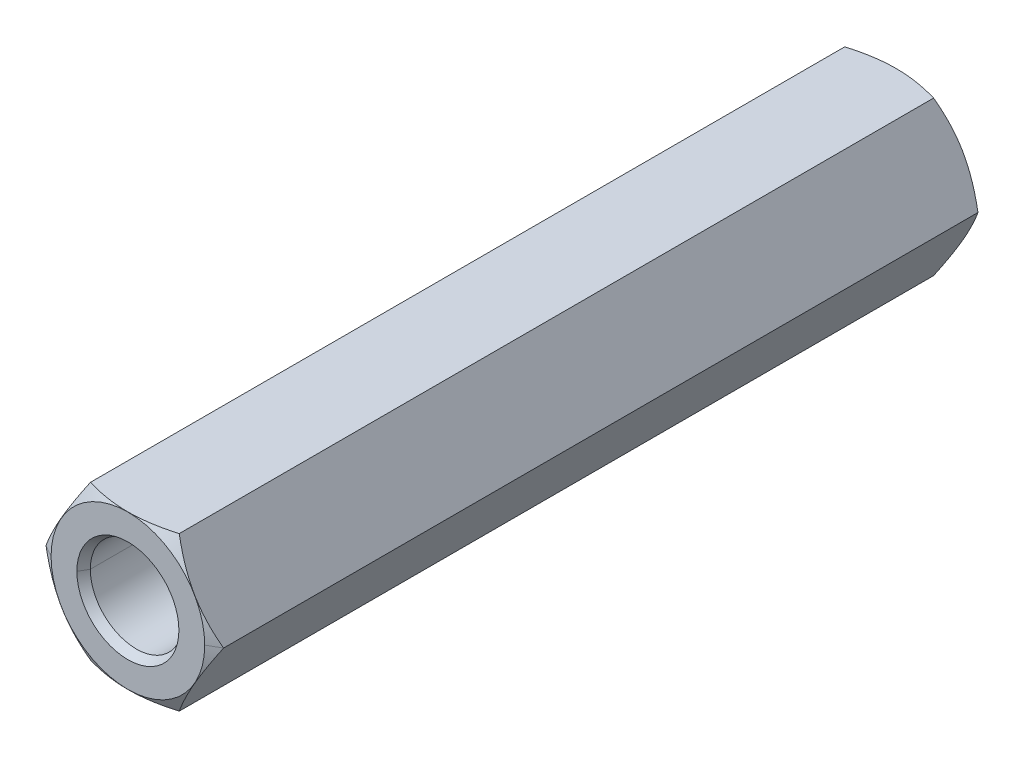
ISO-10303-21;
HEADER;
FILE_DESCRIPTION(('STEP AP214'),'2;1');
FILE_NAME('part.step','',(''),(''),'','','');
FILE_SCHEMA(('AUTOMOTIVE_DESIGN { 1 0 10303 214 1 1 1 1 }'));
ENDSEC;
DATA;
#1=APPLICATION_CONTEXT('core data for automotive mechanical design processes');
#2=APPLICATION_PROTOCOL_DEFINITION('international standard','automotive_design',2000,#1);
#3=PRODUCT_CONTEXT('',#1,'mechanical');
#4=PRODUCT('Part','Part','',(#3));
#5=PRODUCT_RELATED_PRODUCT_CATEGORY('part','',(#4));
#6=PRODUCT_DEFINITION_FORMATION('','',#4);
#7=PRODUCT_DEFINITION_CONTEXT('part definition',#1,'design');
#8=PRODUCT_DEFINITION('design','',#6,#7);
#9=PRODUCT_DEFINITION_SHAPE('','',#8);
#10=(LENGTH_UNIT() NAMED_UNIT(*) SI_UNIT(.MILLI.,.METRE.));
#11=(NAMED_UNIT(*) PLANE_ANGLE_UNIT() SI_UNIT($,.RADIAN.));
#12=(NAMED_UNIT(*) SI_UNIT($,.STERADIAN.) SOLID_ANGLE_UNIT());
#13=UNCERTAINTY_MEASURE_WITH_UNIT(LENGTH_MEASURE(1.E-05),#10,'distance_accuracy_value','');
#14=(GEOMETRIC_REPRESENTATION_CONTEXT(3) GLOBAL_UNCERTAINTY_ASSIGNED_CONTEXT((#13)) GLOBAL_UNIT_ASSIGNED_CONTEXT((#10,
#11,#12)) REPRESENTATION_CONTEXT('',''));
#15=CARTESIAN_POINT('',(0.,0.,0.));
#16=DIRECTION('',(0.,0.,1.));
#17=DIRECTION('',(1.,0.,0.));
#18=AXIS2_PLACEMENT_3D('',#15,#16,#17);
#19=CARTESIAN_POINT('',(116.318744279938,128.562043292351,120.447608312383));
#20=DIRECTION('',(0.,0.,-1.));
#21=DIRECTION('',(1.,0.,0.));
#22=AXIS2_PLACEMENT_3D('',#19,#20,#21);
#23=CONICAL_SURFACE('',#22,1.73205080757048,1.047197551197);
#24=DIRECTION('',(0.86602540378464,0.,-0.499999999999652));
#25=VECTOR('',#24,1.);
#26=CARTESIAN_POINT('',(118.050795087508,128.562043292351,120.447608312383));
#27=LINE('',#26,#25);
#28=CARTESIAN_POINT('',(116.318744279938,128.562043292351,121.447608312383));
#29=VERTEX_POINT('',#28);
#30=CARTESIAN_POINT('',(117.818744279938,128.562043292351,120.581582908599));
#31=VERTEX_POINT('',#30);
#32=EDGE_CURVE('E67',#29,#31,#27,.T.);
#33=ORIENTED_EDGE('',*,*,#32,.F.);
#34=DIRECTION('',(-0.86602540378464,0.,-0.499999999999652));
#35=VECTOR('',#34,1.);
#36=CARTESIAN_POINT('',(114.586693472367,128.562043292351,120.447608312383));
#37=LINE('',#36,#35);
#38=CARTESIAN_POINT('',(114.818744279938,128.562043292351,120.581582908599));
#39=VERTEX_POINT('',#38);
#40=EDGE_CURVE('E11',#29,#39,#37,.T.);
#41=ORIENTED_EDGE('',*,*,#40,.T.);
#42=CARTESIAN_POINT('',(116.318744279938,128.562043292351,120.581582908599));
#43=DIRECTION('',(0.,0.,1.));
#44=DIRECTION('',(1.,0.,0.));
#45=AXIS2_PLACEMENT_3D('',#42,#43,#44);
#46=CIRCLE('',#45,1.5);
#47=EDGE_CURVE('E55',#31,#39,#46,.T.);
#48=ORIENTED_EDGE('',*,*,#47,.F.);
#49=EDGE_LOOP('',(#33,#41,#48));
#50=FACE_BOUND('',#49,.T.);
#51=ADVANCED_FACE('F44',(#50),#23,.F.);
#52=CARTESIAN_POINT('',(116.318744279938,128.562043292351,120.581582908599));
#53=DIRECTION('',(0.,0.,-1.));
#54=DIRECTION('',(1.,0.,0.));
#55=AXIS2_PLACEMENT_3D('',#52,#53,#54);
#56=CYLINDRICAL_SURFACE('',#55,1.5);
#57=ORIENTED_EDGE('',*,*,#47,.T.);
#58=DIRECTION('',(0.,0.,-1.));
#59=VECTOR('',#58,1.);
#60=CARTESIAN_POINT('',(114.818744279938,128.562043292351,120.581582908599));
#61=LINE('',#60,#59);
#62=CARTESIAN_POINT('',(114.818744279938,128.562043292351,110.858711037809));
#63=VERTEX_POINT('',#62);
#64=EDGE_CURVE('E212',#39,#63,#61,.T.);
#65=ORIENTED_EDGE('',*,*,#64,.T.);
#66=CARTESIAN_POINT('',(116.318744279938,128.562043292351,110.858711037809));
#67=DIRECTION('',(0.,0.,1.));
#68=DIRECTION('',(1.,0.,0.));
#69=AXIS2_PLACEMENT_3D('',#66,#67,#68);
#70=CIRCLE('',#69,1.5);
#71=CARTESIAN_POINT('',(117.818744279938,128.562043292351,110.858711037809));
#72=VERTEX_POINT('',#71);
#73=EDGE_CURVE('E204',#72,#63,#70,.T.);
#74=ORIENTED_EDGE('',*,*,#73,.F.);
#75=DIRECTION('',(0.,0.,-1.));
#76=VECTOR('',#75,1.);
#77=CARTESIAN_POINT('',(117.818744279938,128.562043292351,120.581582908599));
#78=LINE('',#77,#76);
#79=EDGE_CURVE('E196',#31,#72,#78,.T.);
#80=ORIENTED_EDGE('',*,*,#79,.F.);
#81=EDGE_LOOP('',(#57,#65,#74,#80));
#82=FACE_BOUND('',#81,.T.);
#83=ADVANCED_FACE('F201',(#82),#56,.F.);
#84=CARTESIAN_POINT('',(116.318744279938,128.562043292351,110.858711037809));
#85=DIRECTION('',(0.,0.,-1.));
#86=DIRECTION('',(1.,0.,0.));
#87=AXIS2_PLACEMENT_3D('',#84,#85,#86);
#88=CONICAL_SURFACE('',#87,1.5,0.5235987756);
#89=ORIENTED_EDGE('',*,*,#73,.T.);
#90=DIRECTION('',(-0.500000000001473,0.,-0.866025403783588));
#91=VECTOR('',#90,1.);
#92=CARTESIAN_POINT('',(114.818744279938,128.562043292351,110.858711037809));
#93=LINE('',#92,#91);
#94=CARTESIAN_POINT('',(114.658744279938,128.562043292351,110.581582908599));
#95=VERTEX_POINT('',#94);
#96=EDGE_CURVE('E277',#63,#95,#93,.T.);
#97=ORIENTED_EDGE('',*,*,#96,.T.);
#98=CARTESIAN_POINT('',(116.318744279938,128.562043292351,110.581582908599));
#99=DIRECTION('',(0.,0.,1.));
#100=DIRECTION('',(1.,0.,0.));
#101=AXIS2_PLACEMENT_3D('',#98,#99,#100);
#102=CIRCLE('',#101,1.66);
#103=CARTESIAN_POINT('',(117.978744279938,128.562043292351,110.581582908599));
#104=VERTEX_POINT('',#103);
#105=EDGE_CURVE('E304',#104,#95,#102,.T.);
#106=ORIENTED_EDGE('',*,*,#105,.F.);
#107=DIRECTION('',(0.500000000001473,0.,-0.866025403783588));
#108=VECTOR('',#107,1.);
#109=CARTESIAN_POINT('',(117.818744279938,128.562043292351,110.858711037809));
#110=LINE('',#109,#108);
#111=EDGE_CURVE('E216',#72,#104,#110,.T.);
#112=ORIENTED_EDGE('',*,*,#111,.F.);
#113=EDGE_LOOP('',(#89,#97,#106,#112));
#114=FACE_BOUND('',#113,.T.);
#115=ADVANCED_FACE('F507',(#114),#88,.F.);
#116=CARTESIAN_POINT('',(116.318744279938,128.562043292351,110.581582908599));
#117=DIRECTION('',(0.,0.,1.));
#118=DIRECTION('',(1.,0.,0.));
#119=AXIS2_PLACEMENT_3D('',#116,#117,#118);
#120=CONICAL_SURFACE('',#119,2.5,1.047197551197);
#121=CARTESIAN_POINT('',(116.318744279938,128.562043292351,110.581582908599));
#122=DIRECTION('',(0.,0.,1.));
#123=DIRECTION('',(1.,0.,0.));
#124=AXIS2_PLACEMENT_3D('',#121,#122,#123);
#125=CIRCLE('',#124,2.5);
#126=CARTESIAN_POINT('',(118.818744279938,128.562043292351,110.581582908599));
#127=VERTEX_POINT('',#126);
#128=CARTESIAN_POINT('',(113.818744279938,128.562043292351,110.581582908599));
#129=VERTEX_POINT('',#128);
#130=EDGE_CURVE('E241',#127,#129,#125,.T.);
#131=ORIENTED_EDGE('',*,*,#130,.T.);
#132=DIRECTION('',(-0.86602540378464,0.,0.499999999999652));
#133=VECTOR('',#132,1.);
#134=CARTESIAN_POINT('',(113.818744279938,128.562043292351,110.581582908599));
#135=LINE('',#134,#133);
#136=CARTESIAN_POINT('',(113.428744279938,128.56204329235,110.806749513583));
#137=VERTEX_POINT('',#136);
#138=EDGE_CURVE('E234',#129,#137,#135,.T.);
#139=ORIENTED_EDGE('',*,*,#138,.T.);
#140=CARTESIAN_POINT('',(114.873744279938,131.064856709287,110.806749513583));
#141=CARTESIAN_POINT('',(114.151244279938,129.813450000819,110.389613944093));
#142=CARTESIAN_POINT('',(113.428744279938,128.56204329235,110.806749513583));
#143=(BOUNDED_CURVE() B_SPLINE_CURVE(2,(#140,#141,#142),.UNSPECIFIED.,.F.,
.F.) B_SPLINE_CURVE_WITH_KNOTS((3,3),(0.,1.),
.UNSPECIFIED.) CURVE() GEOMETRIC_REPRESENTATION_ITEM() RATIONAL_B_SPLINE_CURVE((1.,
1.15470053837935,1.)) REPRESENTATION_ITEM(''));
#144=CARTESIAN_POINT('',(114.873744279938,131.064856709287,110.806749513583));
#145=VERTEX_POINT('',#144);
#146=EDGE_CURVE('E259',#145,#137,#143,.T.);
#147=ORIENTED_EDGE('',*,*,#146,.F.);
#148=CARTESIAN_POINT('',(117.763744279938,131.064856709287,110.806749513583));
#149=CARTESIAN_POINT('',(116.318744279938,131.064856709288,110.389613944093));
#150=CARTESIAN_POINT('',(114.873744279938,131.064856709287,110.806749513583));
#151=(BOUNDED_CURVE() B_SPLINE_CURVE(2,(#148,#149,#150),.UNSPECIFIED.,.F.,
.F.) B_SPLINE_CURVE_WITH_KNOTS((3,3),(0.,1.),
.UNSPECIFIED.) CURVE() GEOMETRIC_REPRESENTATION_ITEM() RATIONAL_B_SPLINE_CURVE((1.,
1.15470053837926,1.)) REPRESENTATION_ITEM(''));
#152=CARTESIAN_POINT('',(117.763744279938,131.064856709287,110.806749513583));
#153=VERTEX_POINT('',#152);
#154=EDGE_CURVE('E228',#153,#145,#151,.T.);
#155=ORIENTED_EDGE('',*,*,#154,.F.);
#156=CARTESIAN_POINT('',(119.208744279938,128.562043292351,110.806749513583));
#157=CARTESIAN_POINT('',(118.486244279938,129.813450000819,110.389613944093));
#158=CARTESIAN_POINT('',(117.763744279938,131.064856709287,110.806749513583));
#159=(BOUNDED_CURVE() B_SPLINE_CURVE(2,(#156,#157,#158),.UNSPECIFIED.,.F.,
.F.) B_SPLINE_CURVE_WITH_KNOTS((3,3),(0.,1.),
.UNSPECIFIED.) CURVE() GEOMETRIC_REPRESENTATION_ITEM() RATIONAL_B_SPLINE_CURVE((1.,
1.15470053837946,1.)) REPRESENTATION_ITEM(''));
#160=CARTESIAN_POINT('',(119.208744279938,128.562043292351,110.806749513583));
#161=VERTEX_POINT('',#160);
#162=EDGE_CURVE('E825',#161,#153,#159,.T.);
#163=ORIENTED_EDGE('',*,*,#162,.F.);
#164=DIRECTION('',(0.86602540378464,0.,0.499999999999652));
#165=VECTOR('',#164,1.);
#166=CARTESIAN_POINT('',(118.818744279938,128.562043292351,110.581582908599));
#167=LINE('',#166,#165);
#168=EDGE_CURVE('E802',#127,#161,#167,.T.);
#169=ORIENTED_EDGE('',*,*,#168,.F.);
#170=EDGE_LOOP('',(#131,#139,#147,#155,#163,#169));
#171=FACE_BOUND('',#170,.T.);
#172=ADVANCED_FACE('F544',(#171),#120,.T.);
#173=CARTESIAN_POINT('',(116.318744279938,128.562043292351,135.356416303615));
#174=DIRECTION('',(0.,0.,-1.));
#175=DIRECTION('',(1.,0.,0.));
#176=AXIS2_PLACEMENT_3D('',#173,#174,#175);
#177=CONICAL_SURFACE('',#176,2.89,1.047197551197);
#178=CARTESIAN_POINT('',(116.318744279938,128.562043292351,135.581582908599));
#179=DIRECTION('',(0.,0.,1.));
#180=DIRECTION('',(1.,0.,0.));
#181=AXIS2_PLACEMENT_3D('',#178,#179,#180);
#182=CIRCLE('',#181,2.5);
#183=CARTESIAN_POINT('',(113.818744279938,128.562043292351,135.581582908599));
#184=VERTEX_POINT('',#183);
#185=CARTESIAN_POINT('',(118.818744279938,128.562043292351,135.581582908599));
#186=VERTEX_POINT('',#185);
#187=EDGE_CURVE('E366',#184,#186,#182,.T.);
#188=ORIENTED_EDGE('',*,*,#187,.F.);
#189=DIRECTION('',(-0.86602540378464,0.,-0.499999999999652));
#190=VECTOR('',#189,1.);
#191=CARTESIAN_POINT('',(113.428744279938,128.562043292351,135.356416303615));
#192=LINE('',#191,#190);
#193=CARTESIAN_POINT('',(113.428744279938,128.562043292351,135.356416303615));
#194=VERTEX_POINT('',#193);
#195=EDGE_CURVE('E242',#184,#194,#192,.T.);
#196=ORIENTED_EDGE('',*,*,#195,.T.);
#197=CARTESIAN_POINT('',(114.873744279938,126.059229875413,135.356416303615));
#198=CARTESIAN_POINT('',(114.151244279938,127.310636583882,135.773551873104));
#199=CARTESIAN_POINT('',(113.428744279938,128.562043292351,135.356416303615));
#200=(BOUNDED_CURVE() B_SPLINE_CURVE(2,(#197,#198,#199),.UNSPECIFIED.,.F.,
.F.) B_SPLINE_CURVE_WITH_KNOTS((3,3),(0.,1.),
.UNSPECIFIED.) CURVE() GEOMETRIC_REPRESENTATION_ITEM() RATIONAL_B_SPLINE_CURVE((1.,
1.15470053837936,1.)) REPRESENTATION_ITEM(''));
#201=CARTESIAN_POINT('',(114.873744279938,126.059229875413,135.356416303615));
#202=VERTEX_POINT('',#201);
#203=EDGE_CURVE('E332',#202,#194,#200,.T.);
#204=ORIENTED_EDGE('',*,*,#203,.F.);
#205=CARTESIAN_POINT('',(117.763744279938,126.059229875413,135.356416303615));
#206=CARTESIAN_POINT('',(116.318744279938,126.059229875413,135.773551873104));
#207=CARTESIAN_POINT('',(114.873744279938,126.059229875413,135.356416303615));
#208=(BOUNDED_CURVE() B_SPLINE_CURVE(2,(#205,#206,#207),.UNSPECIFIED.,.F.,
.F.) B_SPLINE_CURVE_WITH_KNOTS((3,3),(0.,1.),
.UNSPECIFIED.) CURVE() GEOMETRIC_REPRESENTATION_ITEM() RATIONAL_B_SPLINE_CURVE((1.,
1.15470053837925,1.)) REPRESENTATION_ITEM(''));
#209=CARTESIAN_POINT('',(117.763744279938,126.059229875413,135.356416303615));
#210=VERTEX_POINT('',#209);
#211=EDGE_CURVE('E113',#210,#202,#208,.T.);
#212=ORIENTED_EDGE('',*,*,#211,.F.);
#213=CARTESIAN_POINT('',(119.208744279938,128.562043292351,135.356416303615));
#214=CARTESIAN_POINT('',(118.486244279938,127.310636583882,135.773551873104));
#215=CARTESIAN_POINT('',(117.763744279938,126.059229875413,135.356416303615));
#216=(BOUNDED_CURVE() B_SPLINE_CURVE(2,(#213,#214,#215),.UNSPECIFIED.,.F.,
.F.) B_SPLINE_CURVE_WITH_KNOTS((3,3),(0.,1.),
.UNSPECIFIED.) CURVE() GEOMETRIC_REPRESENTATION_ITEM() RATIONAL_B_SPLINE_CURVE((1.,
1.15470053837944,1.)) REPRESENTATION_ITEM(''));
#217=CARTESIAN_POINT('',(119.208744279938,128.562043292351,135.356416303615));
#218=VERTEX_POINT('',#217);
#219=EDGE_CURVE('E355',#218,#210,#216,.T.);
#220=ORIENTED_EDGE('',*,*,#219,.F.);
#221=DIRECTION('',(0.86602540378464,0.,-0.499999999999652));
#222=VECTOR('',#221,1.);
#223=CARTESIAN_POINT('',(119.208744279938,128.562043292351,135.356416303615));
#224=LINE('',#223,#222);
#225=EDGE_CURVE('E360',#186,#218,#224,.T.);
#226=ORIENTED_EDGE('',*,*,#225,.F.);
#227=EDGE_LOOP('',(#188,#196,#204,#212,#220,#226));
#228=FACE_BOUND('',#227,.T.);
#229=ADVANCED_FACE('F539',(#228),#177,.T.);
#230=CARTESIAN_POINT('',(116.318744279938,128.562043292351,135.581582908599));
#231=DIRECTION('',(0.,0.,1.));
#232=DIRECTION('',(1.,0.,0.));
#233=AXIS2_PLACEMENT_3D('',#230,#231,#232);
#234=CONICAL_SURFACE('',#233,1.65999999999899,0.523598775598);
#235=CARTESIAN_POINT('',(116.318744279938,128.562043292351,135.304454779389));
#236=DIRECTION('',(0.,0.,1.));
#237=DIRECTION('',(1.,0.,0.));
#238=AXIS2_PLACEMENT_3D('',#235,#236,#237);
#239=CIRCLE('',#238,1.5);
#240=CARTESIAN_POINT('',(114.818744279938,128.562043292351,135.304454779389));
#241=VERTEX_POINT('',#240);
#242=CARTESIAN_POINT('',(117.818744279938,128.562043292351,135.304454779389));
#243=VERTEX_POINT('',#242);
#244=EDGE_CURVE('E251',#241,#243,#239,.T.);
#245=ORIENTED_EDGE('',*,*,#244,.F.);
#246=DIRECTION('',(-0.499999999999741,0.,0.866025403784588));
#247=VECTOR('',#246,1.);
#248=CARTESIAN_POINT('',(114.658744279939,128.562043292351,135.581582908599));
#249=LINE('',#248,#247);
#250=CARTESIAN_POINT('',(114.658744279939,128.562043292351,135.581582908599));
#251=VERTEX_POINT('',#250);
#252=EDGE_CURVE('E338',#241,#251,#249,.T.);
#253=ORIENTED_EDGE('',*,*,#252,.T.);
#254=CARTESIAN_POINT('',(116.318744279938,128.562043292351,135.581582908599));
#255=DIRECTION('',(0.,0.,1.));
#256=DIRECTION('',(1.,0.,0.));
#257=AXIS2_PLACEMENT_3D('',#254,#255,#256);
#258=CIRCLE('',#257,1.65999999999899);
#259=CARTESIAN_POINT('',(117.978744279937,128.562043292351,135.581582908599));
#260=VERTEX_POINT('',#259);
#261=EDGE_CURVE('E226',#251,#260,#258,.T.);
#262=ORIENTED_EDGE('',*,*,#261,.T.);
#263=DIRECTION('',(0.499999999999741,0.,0.866025403784588));
#264=VECTOR('',#263,1.);
#265=CARTESIAN_POINT('',(117.978744279937,128.562043292351,135.581582908599));
#266=LINE('',#265,#264);
#267=EDGE_CURVE('E322',#243,#260,#266,.T.);
#268=ORIENTED_EDGE('',*,*,#267,.F.);
#269=EDGE_LOOP('',(#245,#253,#262,#268));
#270=FACE_BOUND('',#269,.T.);
#271=ADVANCED_FACE('F543',(#270),#234,.F.);
#272=CARTESIAN_POINT('',(116.318744279938,128.562043292351,135.304454779389));
#273=DIRECTION('',(0.,0.,-1.));
#274=DIRECTION('',(1.,0.,0.));
#275=AXIS2_PLACEMENT_3D('',#272,#273,#274);
#276=CYLINDRICAL_SURFACE('',#275,1.5);
#277=CARTESIAN_POINT('',(116.318744279938,128.562043292351,135.304454779389));
#278=DIRECTION('',(0.,0.,1.));
#279=DIRECTION('',(1.,0.,0.));
#280=AXIS2_PLACEMENT_3D('',#277,#278,#279);
#281=CIRCLE('',#280,1.5);
#282=EDGE_CURVE('E347',#243,#241,#281,.T.);
#283=ORIENTED_EDGE('',*,*,#282,.T.);
#284=DIRECTION('',(0.,0.,-1.));
#285=VECTOR('',#284,1.);
#286=CARTESIAN_POINT('',(114.818744279938,128.562043292351,135.304454779389));
#287=LINE('',#286,#285);
#288=CARTESIAN_POINT('',(114.818744279938,128.562043292351,125.581582908599));
#289=VERTEX_POINT('',#288);
#290=EDGE_CURVE('E316',#241,#289,#287,.T.);
#291=ORIENTED_EDGE('',*,*,#290,.T.);
#292=CARTESIAN_POINT('',(116.318744279938,128.562043292351,125.581582908599));
#293=DIRECTION('',(0.,0.,1.));
#294=DIRECTION('',(1.,0.,0.));
#295=AXIS2_PLACEMENT_3D('',#292,#293,#294);
#296=CIRCLE('',#295,1.5);
#297=CARTESIAN_POINT('',(117.818744279938,128.562043292351,125.581582908599));
#298=VERTEX_POINT('',#297);
#299=EDGE_CURVE('E254',#298,#289,#296,.T.);
#300=ORIENTED_EDGE('',*,*,#299,.F.);
#301=DIRECTION('',(0.,0.,-1.));
#302=VECTOR('',#301,1.);
#303=CARTESIAN_POINT('',(117.818744279938,128.562043292351,135.304454779389));
#304=LINE('',#303,#302);
#305=EDGE_CURVE('E255',#243,#298,#304,.T.);
#306=ORIENTED_EDGE('',*,*,#305,.F.);
#307=EDGE_LOOP('',(#283,#291,#300,#306));
#308=FACE_BOUND('',#307,.T.);
#309=ADVANCED_FACE('F519',(#308),#276,.F.);
#310=CARTESIAN_POINT('',(116.318744279938,128.562043292351,125.581582908599));
#311=DIRECTION('',(0.,0.,1.));
#312=DIRECTION('',(1.,0.,0.));
#313=AXIS2_PLACEMENT_3D('',#310,#311,#312);
#314=CONICAL_SURFACE('',#313,1.5,1.047197551197);
#315=DIRECTION('',(0.86602540378464,0.,0.499999999999652));
#316=VECTOR('',#315,1.);
#317=CARTESIAN_POINT('',(117.818744279938,128.562043292351,125.581582908599));
#318=LINE('',#317,#316);
#319=CARTESIAN_POINT('',(116.318744279938,128.562043292351,124.715557504814));
#320=VERTEX_POINT('',#319);
#321=EDGE_CURVE('E328',#320,#298,#318,.T.);
#322=ORIENTED_EDGE('',*,*,#321,.F.);
#323=DIRECTION('',(-0.86602540378464,0.,0.499999999999652));
#324=VECTOR('',#323,1.);
#325=CARTESIAN_POINT('',(114.818744279938,128.562043292351,125.581582908599));
#326=LINE('',#325,#324);
#327=EDGE_CURVE('E309',#320,#289,#326,.T.);
#328=ORIENTED_EDGE('',*,*,#327,.T.);
#329=CARTESIAN_POINT('',(116.318744279938,128.562043292351,125.581582908599));
#330=DIRECTION('',(0.,0.,1.));
#331=DIRECTION('',(1.,0.,0.));
#332=AXIS2_PLACEMENT_3D('',#329,#330,#331);
#333=CIRCLE('',#332,1.5);
#334=EDGE_CURVE('E317',#289,#298,#333,.T.);
#335=ORIENTED_EDGE('',*,*,#334,.T.);
#336=EDGE_LOOP('',(#322,#328,#335));
#337=FACE_BOUND('',#336,.T.);
#338=ADVANCED_FACE('F515',(#337),#314,.F.);
#339=CARTESIAN_POINT('',(116.318744279938,128.562043292351,125.581582908599));
#340=DIRECTION('',(0.,0.,1.));
#341=DIRECTION('',(1.,0.,0.));
#342=AXIS2_PLACEMENT_3D('',#339,#340,#341);
#343=CONICAL_SURFACE('',#342,1.5,1.047197551197);
#344=ORIENTED_EDGE('',*,*,#327,.F.);
#345=ORIENTED_EDGE('',*,*,#321,.T.);
#346=ORIENTED_EDGE('',*,*,#299,.T.);
#347=EDGE_LOOP('',(#344,#345,#346));
#348=FACE_BOUND('',#347,.T.);
#349=ADVANCED_FACE('F460',(#348),#343,.F.);
#350=CARTESIAN_POINT('',(116.318744279938,128.562043292351,135.304454779389));
#351=DIRECTION('',(0.,0.,-1.));
#352=DIRECTION('',(1.,0.,0.));
#353=AXIS2_PLACEMENT_3D('',#350,#351,#352);
#354=CYLINDRICAL_SURFACE('',#353,1.5);
#355=ORIENTED_EDGE('',*,*,#290,.F.);
#356=ORIENTED_EDGE('',*,*,#244,.T.);
#357=ORIENTED_EDGE('',*,*,#305,.T.);
#358=ORIENTED_EDGE('',*,*,#334,.F.);
#359=EDGE_LOOP('',(#355,#356,#357,#358));
#360=FACE_BOUND('',#359,.T.);
#361=ADVANCED_FACE('F425',(#360),#354,.F.);
#362=CARTESIAN_POINT('',(116.318744279938,128.562043292351,135.581582908599));
#363=DIRECTION('',(0.,0.,1.));
#364=DIRECTION('',(1.,0.,0.));
#365=AXIS2_PLACEMENT_3D('',#362,#363,#364);
#366=CONICAL_SURFACE('',#365,1.65999999999899,0.523598775598);
#367=ORIENTED_EDGE('',*,*,#252,.F.);
#368=ORIENTED_EDGE('',*,*,#282,.F.);
#369=ORIENTED_EDGE('',*,*,#267,.T.);
#370=CARTESIAN_POINT('',(116.318744279938,128.562043292351,135.581582908599));
#371=DIRECTION('',(0.,0.,1.));
#372=DIRECTION('',(1.,0.,0.));
#373=AXIS2_PLACEMENT_3D('',#370,#371,#372);
#374=CIRCLE('',#373,1.65999999999899);
#375=EDGE_CURVE('E318',#260,#251,#374,.T.);
#376=ORIENTED_EDGE('',*,*,#375,.T.);
#377=EDGE_LOOP('',(#367,#368,#369,#376));
#378=FACE_BOUND('',#377,.T.);
#379=ADVANCED_FACE('F420',(#378),#366,.F.);
#380=CARTESIAN_POINT('',(116.318744279938,128.562043292351,135.581582908599));
#381=DIRECTION('',(0.,0.,1.));
#382=DIRECTION('',(1.,0.,0.));
#383=AXIS2_PLACEMENT_3D('',#380,#381,#382);
#384=PLANE('',#383);
#385=CARTESIAN_POINT('',(116.318744279938,128.562043292351,135.581582908599));
#386=DIRECTION('',(0.,0.,1.));
#387=DIRECTION('',(1.,0.,0.));
#388=AXIS2_PLACEMENT_3D('',#385,#386,#387);
#389=CIRCLE('',#388,2.5);
#390=EDGE_CURVE('E323',#186,#184,#389,.T.);
#391=ORIENTED_EDGE('',*,*,#390,.T.);
#392=ORIENTED_EDGE('',*,*,#187,.T.);
#393=EDGE_LOOP('',(#391,#392));
#394=FACE_BOUND('',#393,.T.);
#395=ORIENTED_EDGE('',*,*,#375,.F.);
#396=ORIENTED_EDGE('',*,*,#261,.F.);
#397=EDGE_LOOP('',(#395,#396));
#398=FACE_BOUND('',#397,.T.);
#399=ADVANCED_FACE('F424',(#394,#398),#384,.T.);
#400=CARTESIAN_POINT('',(116.318744279938,128.562043292351,135.356416303615));
#401=DIRECTION('',(0.,0.,-1.));
#402=DIRECTION('',(1.,0.,0.));
#403=AXIS2_PLACEMENT_3D('',#400,#401,#402);
#404=CONICAL_SURFACE('',#403,2.89,1.047197551197);
#405=ORIENTED_EDGE('',*,*,#195,.F.);
#406=ORIENTED_EDGE('',*,*,#390,.F.);
#407=ORIENTED_EDGE('',*,*,#225,.T.);
#408=CARTESIAN_POINT('',(117.763744279938,131.064856709287,135.356416303615));
#409=CARTESIAN_POINT('',(118.486244279938,129.813450000819,135.773551873104));
#410=CARTESIAN_POINT('',(119.208744279938,128.562043292351,135.356416303615));
#411=(BOUNDED_CURVE() B_SPLINE_CURVE(2,(#408,#409,#410),.UNSPECIFIED.,.F.,
.F.) B_SPLINE_CURVE_WITH_KNOTS((3,3),(0.,1.),
.UNSPECIFIED.) CURVE() GEOMETRIC_REPRESENTATION_ITEM() RATIONAL_B_SPLINE_CURVE((1.,
1.15470053837935,1.)) REPRESENTATION_ITEM(''));
#412=CARTESIAN_POINT('',(117.763744279938,131.064856709287,135.356416303615));
#413=VERTEX_POINT('',#412);
#414=EDGE_CURVE('E128',#413,#218,#411,.T.);
#415=ORIENTED_EDGE('',*,*,#414,.F.);
#416=CARTESIAN_POINT('',(114.873744279938,131.064856709287,135.356416303615));
#417=CARTESIAN_POINT('',(116.318744279938,131.064856709287,135.773551873104));
#418=CARTESIAN_POINT('',(117.763744279938,131.064856709287,135.356416303615));
#419=(BOUNDED_CURVE() B_SPLINE_CURVE(2,(#416,#417,#418),.UNSPECIFIED.,.F.,
.F.) B_SPLINE_CURVE_WITH_KNOTS((3,3),(0.,1.),
.UNSPECIFIED.) CURVE() GEOMETRIC_REPRESENTATION_ITEM() RATIONAL_B_SPLINE_CURVE((1.,
1.15470053837925,1.)) REPRESENTATION_ITEM(''));
#420=CARTESIAN_POINT('',(114.873744279938,131.064856709287,135.356416303615));
#421=VERTEX_POINT('',#420);
#422=EDGE_CURVE('E232',#421,#413,#419,.T.);
#423=ORIENTED_EDGE('',*,*,#422,.F.);
#424=CARTESIAN_POINT('',(113.428744279938,128.562043292351,135.356416303615));
#425=CARTESIAN_POINT('',(114.151244279937,129.813450000819,135.773551873104));
#426=CARTESIAN_POINT('',(114.873744279938,131.064856709287,135.356416303615));
#427=(BOUNDED_CURVE() B_SPLINE_CURVE(2,(#424,#425,#426),.UNSPECIFIED.,.F.,
.F.) B_SPLINE_CURVE_WITH_KNOTS((3,3),(0.,1.),
.UNSPECIFIED.) CURVE() GEOMETRIC_REPRESENTATION_ITEM() RATIONAL_B_SPLINE_CURVE((1.,
1.15470053837944,1.)) REPRESENTATION_ITEM(''));
#428=EDGE_CURVE('E248',#194,#421,#427,.T.);
#429=ORIENTED_EDGE('',*,*,#428,.F.);
#430=EDGE_LOOP('',(#405,#406,#407,#415,#423,#429));
#431=FACE_BOUND('',#430,.T.);
#432=ADVANCED_FACE('F472',(#431),#404,.T.);
#433=CARTESIAN_POINT('',(117.763744279938,126.059229875413,110.581582908599));
#434=DIRECTION('',(-0.866025403784329,0.50000000000019,0.));
#435=DIRECTION('',(0.,0.,1.));
#436=AXIS2_PLACEMENT_3D('',#433,#434,#435);
#437=PLANE('',#436);
#438=DIRECTION('',(0.,0.,1.));
#439=VECTOR('',#438,1.);
#440=CARTESIAN_POINT('',(119.208744279938,128.562043292351,110.806749513583));
#441=LINE('',#440,#439);
#442=EDGE_CURVE('E359',#161,#218,#441,.T.);
#443=ORIENTED_EDGE('',*,*,#442,.T.);
#444=ORIENTED_EDGE('',*,*,#219,.T.);
#445=DIRECTION('',(0.,0.,1.));
#446=VECTOR('',#445,1.);
#447=CARTESIAN_POINT('',(117.763744279938,126.059229875413,110.581582908599));
#448=LINE('',#447,#446);
#449=CARTESIAN_POINT('',(117.763744279938,126.059229875413,110.806749513583));
#450=VERTEX_POINT('',#449);
#451=EDGE_CURVE('E285',#450,#210,#448,.T.);
#452=ORIENTED_EDGE('',*,*,#451,.F.);
#453=CARTESIAN_POINT('',(117.763744279938,126.059229875413,110.806749513583));
#454=CARTESIAN_POINT('',(118.486244279938,127.310636583882,110.389613944093));
#455=CARTESIAN_POINT('',(119.208744279938,128.562043292351,110.806749513583));
#456=(BOUNDED_CURVE() B_SPLINE_CURVE(2,(#453,#454,#455),.UNSPECIFIED.,.F.,
.F.) B_SPLINE_CURVE_WITH_KNOTS((3,3),(0.,1.),
.UNSPECIFIED.) CURVE() GEOMETRIC_REPRESENTATION_ITEM() RATIONAL_B_SPLINE_CURVE((1.,
1.15470053837935,1.)) REPRESENTATION_ITEM(''));
#457=EDGE_CURVE('E327',#450,#161,#456,.T.);
#458=ORIENTED_EDGE('',*,*,#457,.T.);
#459=EDGE_LOOP('',(#443,#444,#452,#458));
#460=FACE_BOUND('',#459,.T.);
#461=ADVANCED_FACE('F437',(#460),#437,.F.);
#462=CARTESIAN_POINT('',(114.873744279938,126.059229875413,110.581582908599));
#463=DIRECTION('',(0.,1.,0.));
#464=DIRECTION('',(1.,0.,0.));
#465=AXIS2_PLACEMENT_3D('',#462,#463,#464);
#466=PLANE('',#465);
#467=ORIENTED_EDGE('',*,*,#451,.T.);
#468=ORIENTED_EDGE('',*,*,#211,.T.);
#469=DIRECTION('',(0.,0.,1.));
#470=VECTOR('',#469,1.);
#471=CARTESIAN_POINT('',(114.873744279938,126.059229875413,110.581582908599));
#472=LINE('',#471,#470);
#473=CARTESIAN_POINT('',(114.873744279938,126.059229875413,110.806749513583));
#474=VERTEX_POINT('',#473);
#475=EDGE_CURVE('E48',#474,#202,#472,.T.);
#476=ORIENTED_EDGE('',*,*,#475,.F.);
#477=CARTESIAN_POINT('',(114.873744279938,126.059229875413,110.806749513583));
#478=CARTESIAN_POINT('',(116.318744279938,126.059229875414,110.389613944093));
#479=CARTESIAN_POINT('',(117.763744279938,126.059229875413,110.806749513583));
#480=(BOUNDED_CURVE() B_SPLINE_CURVE(2,(#477,#478,#479),.UNSPECIFIED.,.F.,
.F.) B_SPLINE_CURVE_WITH_KNOTS((3,3),(0.,1.),
.UNSPECIFIED.) CURVE() GEOMETRIC_REPRESENTATION_ITEM() RATIONAL_B_SPLINE_CURVE((1.,
1.15470053837926,1.)) REPRESENTATION_ITEM(''));
#481=EDGE_CURVE('E286',#474,#450,#480,.T.);
#482=ORIENTED_EDGE('',*,*,#481,.T.);
#483=EDGE_LOOP('',(#467,#468,#476,#482));
#484=FACE_BOUND('',#483,.T.);
#485=ADVANCED_FACE('F404',(#484),#466,.F.);
#486=CARTESIAN_POINT('',(113.428744279938,128.562043292351,110.581582908599));
#487=DIRECTION('',(0.866025403784329,0.50000000000019,0.));
#488=DIRECTION('',(0.,0.,-1.));
#489=AXIS2_PLACEMENT_3D('',#486,#487,#488);
#490=PLANE('',#489);
#491=ORIENTED_EDGE('',*,*,#475,.T.);
#492=ORIENTED_EDGE('',*,*,#203,.T.);
#493=DIRECTION('',(0.,0.,1.));
#494=VECTOR('',#493,1.);
#495=CARTESIAN_POINT('',(113.428744279938,128.562043292351,110.581582908599));
#496=LINE('',#495,#494);
#497=EDGE_CURVE('E243',#137,#194,#496,.T.);
#498=ORIENTED_EDGE('',*,*,#497,.F.);
#499=CARTESIAN_POINT('',(113.428744279938,128.56204329235,110.806749513583));
#500=CARTESIAN_POINT('',(114.151244279937,127.310636583882,110.389613944093));
#501=CARTESIAN_POINT('',(114.873744279938,126.059229875413,110.806749513583));
#502=(BOUNDED_CURVE() B_SPLINE_CURVE(2,(#499,#500,#501),.UNSPECIFIED.,.F.,
.F.) B_SPLINE_CURVE_WITH_KNOTS((3,3),(0.,1.),
.UNSPECIFIED.) CURVE() GEOMETRIC_REPRESENTATION_ITEM() RATIONAL_B_SPLINE_CURVE((1.,
1.15470053837945,1.)) REPRESENTATION_ITEM(''));
#503=EDGE_CURVE('E247',#137,#474,#502,.T.);
#504=ORIENTED_EDGE('',*,*,#503,.T.);
#505=EDGE_LOOP('',(#491,#492,#498,#504));
#506=FACE_BOUND('',#505,.T.);
#507=ADVANCED_FACE('F396',(#506),#490,.F.);
#508=CARTESIAN_POINT('',(114.873744279938,131.064856709287,110.581582908599));
#509=DIRECTION('',(0.866025403784329,-0.50000000000019,0.));
#510=DIRECTION('',(0.,0.,-1.));
#511=AXIS2_PLACEMENT_3D('',#508,#509,#510);
#512=PLANE('',#511);
#513=ORIENTED_EDGE('',*,*,#497,.T.);
#514=ORIENTED_EDGE('',*,*,#428,.T.);
#515=DIRECTION('',(0.,0.,1.));
#516=VECTOR('',#515,1.);
#517=CARTESIAN_POINT('',(114.873744279938,131.064856709287,110.581582908599));
#518=LINE('',#517,#516);
#519=EDGE_CURVE('E256',#145,#421,#518,.T.);
#520=ORIENTED_EDGE('',*,*,#519,.F.);
#521=ORIENTED_EDGE('',*,*,#146,.T.);
#522=EDGE_LOOP('',(#513,#514,#520,#521));
#523=FACE_BOUND('',#522,.T.);
#524=ADVANCED_FACE('F485',(#523),#512,.F.);
#525=CARTESIAN_POINT('',(117.763744279938,131.064856709287,110.581582908599));
#526=DIRECTION('',(0.,-1.,0.));
#527=DIRECTION('',(-1.,0.,0.));
#528=AXIS2_PLACEMENT_3D('',#525,#526,#527);
#529=PLANE('',#528);
#530=ORIENTED_EDGE('',*,*,#519,.T.);
#531=ORIENTED_EDGE('',*,*,#422,.T.);
#532=DIRECTION('',(0.,0.,1.));
#533=VECTOR('',#532,1.);
#534=CARTESIAN_POINT('',(117.763744279938,131.064856709287,110.581582908599));
#535=LINE('',#534,#533);
#536=EDGE_CURVE('E233',#153,#413,#535,.T.);
#537=ORIENTED_EDGE('',*,*,#536,.F.);
#538=ORIENTED_EDGE('',*,*,#154,.T.);
#539=EDGE_LOOP('',(#530,#531,#537,#538));
#540=FACE_BOUND('',#539,.T.);
#541=ADVANCED_FACE('F480',(#540),#529,.F.);
#542=CARTESIAN_POINT('',(119.208744279938,128.562043292351,110.581582908599));
#543=DIRECTION('',(-0.866025403784329,-0.50000000000019,0.));
#544=DIRECTION('',(-0.50000000000019,0.866025403784329,0.));
#545=AXIS2_PLACEMENT_3D('',#542,#543,#544);
#546=PLANE('',#545);
#547=ORIENTED_EDGE('',*,*,#536,.T.);
#548=ORIENTED_EDGE('',*,*,#414,.T.);
#549=ORIENTED_EDGE('',*,*,#442,.F.);
#550=ORIENTED_EDGE('',*,*,#162,.T.);
#551=EDGE_LOOP('',(#547,#548,#549,#550));
#552=FACE_BOUND('',#551,.T.);
#553=ADVANCED_FACE('F484',(#552),#546,.F.);
#554=CARTESIAN_POINT('',(116.318744279938,128.562043292351,110.581582908599));
#555=DIRECTION('',(0.,0.,1.));
#556=DIRECTION('',(1.,0.,0.));
#557=AXIS2_PLACEMENT_3D('',#554,#555,#556);
#558=CONICAL_SURFACE('',#557,2.5,1.047197551197);
#559=ORIENTED_EDGE('',*,*,#138,.F.);
#560=CARTESIAN_POINT('',(116.318744279938,128.562043292351,110.581582908599));
#561=DIRECTION('',(0.,0.,1.));
#562=DIRECTION('',(1.,0.,0.));
#563=AXIS2_PLACEMENT_3D('',#560,#561,#562);
#564=CIRCLE('',#563,2.5);
#565=EDGE_CURVE('E832',#129,#127,#564,.T.);
#566=ORIENTED_EDGE('',*,*,#565,.T.);
#567=ORIENTED_EDGE('',*,*,#168,.T.);
#568=ORIENTED_EDGE('',*,*,#457,.F.);
#569=ORIENTED_EDGE('',*,*,#481,.F.);
#570=ORIENTED_EDGE('',*,*,#503,.F.);
#571=EDGE_LOOP('',(#559,#566,#567,#568,#569,#570));
#572=FACE_BOUND('',#571,.T.);
#573=ADVANCED_FACE('F399',(#572),#558,.T.);
#574=CARTESIAN_POINT('',(116.318744279938,128.562043292351,110.581582908599));
#575=DIRECTION('',(0.,0.,1.));
#576=DIRECTION('',(1.,0.,0.));
#577=AXIS2_PLACEMENT_3D('',#574,#575,#576);
#578=PLANE('',#577);
#579=ORIENTED_EDGE('',*,*,#130,.F.);
#580=ORIENTED_EDGE('',*,*,#565,.F.);
#581=EDGE_LOOP('',(#579,#580));
#582=FACE_BOUND('',#581,.T.);
#583=ORIENTED_EDGE('',*,*,#105,.T.);
#584=CARTESIAN_POINT('',(116.318744279938,128.562043292351,110.581582908599));
#585=DIRECTION('',(0.,0.,1.));
#586=DIRECTION('',(1.,0.,0.));
#587=AXIS2_PLACEMENT_3D('',#584,#585,#586);
#588=CIRCLE('',#587,1.66);
#589=EDGE_CURVE('E300',#95,#104,#588,.T.);
#590=ORIENTED_EDGE('',*,*,#589,.T.);
#591=EDGE_LOOP('',(#583,#590));
#592=FACE_BOUND('',#591,.T.);
#593=ADVANCED_FACE('F448',(#582,#592),#578,.F.);
#594=CARTESIAN_POINT('',(116.318744279938,128.562043292351,110.858711037809));
#595=DIRECTION('',(0.,0.,-1.));
#596=DIRECTION('',(1.,0.,0.));
#597=AXIS2_PLACEMENT_3D('',#594,#595,#596);
#598=CONICAL_SURFACE('',#597,1.5,0.5235987756);
#599=ORIENTED_EDGE('',*,*,#96,.F.);
#600=CARTESIAN_POINT('',(116.318744279938,128.562043292351,110.858711037809));
#601=DIRECTION('',(0.,0.,1.));
#602=DIRECTION('',(1.,0.,0.));
#603=AXIS2_PLACEMENT_3D('',#600,#601,#602);
#604=CIRCLE('',#603,1.5);
#605=EDGE_CURVE('E222',#63,#72,#604,.T.);
#606=ORIENTED_EDGE('',*,*,#605,.T.);
#607=ORIENTED_EDGE('',*,*,#111,.T.);
#608=ORIENTED_EDGE('',*,*,#589,.F.);
#609=EDGE_LOOP('',(#599,#606,#607,#608));
#610=FACE_BOUND('',#609,.T.);
#611=ADVANCED_FACE('F412',(#610),#598,.F.);
#612=CARTESIAN_POINT('',(116.318744279938,128.562043292351,120.581582908599));
#613=DIRECTION('',(0.,0.,-1.));
#614=DIRECTION('',(1.,0.,0.));
#615=AXIS2_PLACEMENT_3D('',#612,#613,#614);
#616=CYLINDRICAL_SURFACE('',#615,1.5);
#617=ORIENTED_EDGE('',*,*,#64,.F.);
#618=CARTESIAN_POINT('',(116.318744279938,128.562043292351,120.581582908599));
#619=DIRECTION('',(0.,0.,1.));
#620=DIRECTION('',(1.,0.,0.));
#621=AXIS2_PLACEMENT_3D('',#618,#619,#620);
#622=CIRCLE('',#621,1.5);
#623=EDGE_CURVE('E194',#39,#31,#622,.T.);
#624=ORIENTED_EDGE('',*,*,#623,.T.);
#625=ORIENTED_EDGE('',*,*,#79,.T.);
#626=ORIENTED_EDGE('',*,*,#605,.F.);
#627=EDGE_LOOP('',(#617,#624,#625,#626));
#628=FACE_BOUND('',#627,.T.);
#629=ADVANCED_FACE('F214',(#628),#616,.F.);
#630=CARTESIAN_POINT('',(116.318744279938,128.562043292351,120.447608312383));
#631=DIRECTION('',(0.,0.,-1.));
#632=DIRECTION('',(1.,0.,0.));
#633=AXIS2_PLACEMENT_3D('',#630,#631,#632);
#634=CONICAL_SURFACE('',#633,1.73205080757048,1.047197551197);
#635=ORIENTED_EDGE('',*,*,#40,.F.);
#636=ORIENTED_EDGE('',*,*,#32,.T.);
#637=ORIENTED_EDGE('',*,*,#623,.F.);
#638=EDGE_LOOP('',(#635,#636,#637));
#639=FACE_BOUND('',#638,.T.);
#640=ADVANCED_FACE('F46',(#639),#634,.F.);
#641=CLOSED_SHELL('',(#51,#83,#115,#172,#229,#271,#309,#338,#349,#361,#379,#399,#432,#461,#485,
#507,#524,#541,#553,#573,#593,#611,#629,#640));
#642=MANIFOLD_SOLID_BREP('B2',#641);
#643=ADVANCED_BREP_SHAPE_REPRESENTATION('',(#18,#642),#14);
#644=SHAPE_DEFINITION_REPRESENTATION(#9,#643);
ENDSEC;
END-ISO-10303-21;
